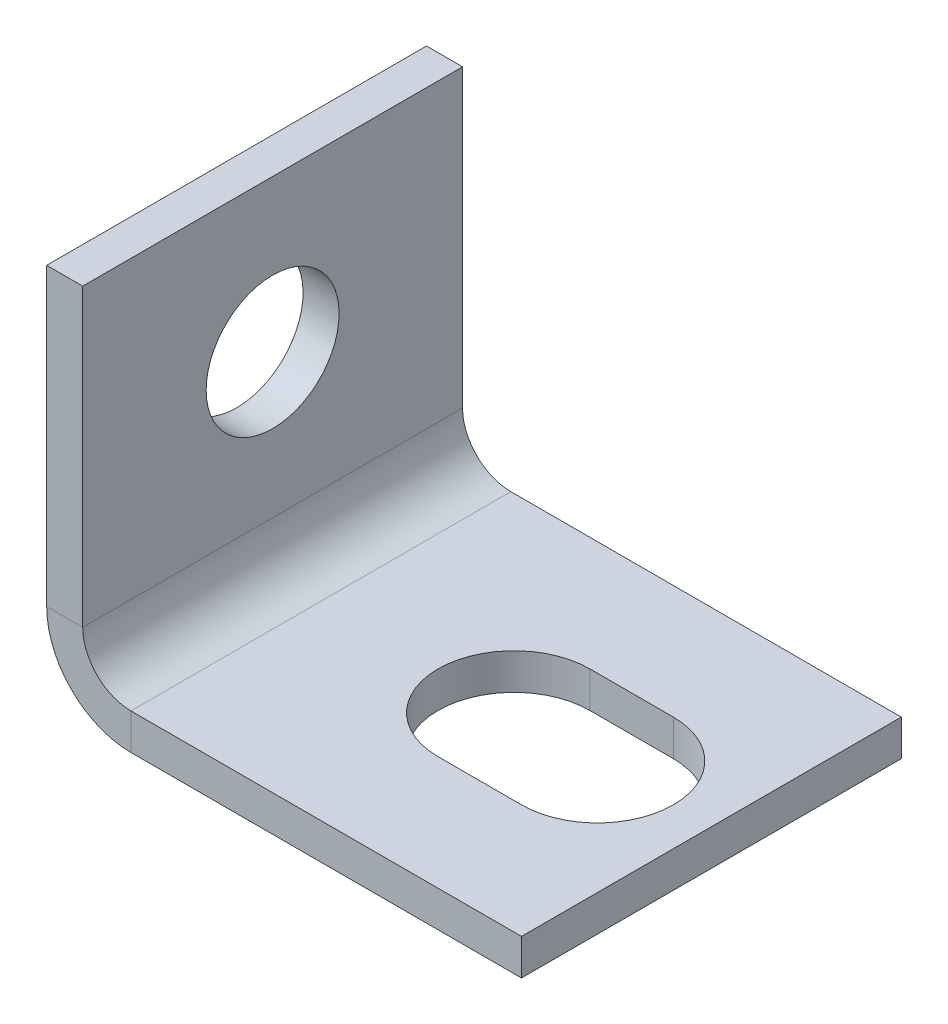
ISO-10303-21;
HEADER;
FILE_DESCRIPTION(('STEP AP214'),'2;1');
FILE_NAME('part.step','',(''),(''),'','','');
FILE_SCHEMA(('AUTOMOTIVE_DESIGN { 1 0 10303 214 1 1 1 1 }'));
ENDSEC;
DATA;
#1=APPLICATION_CONTEXT('core data for automotive mechanical design processes');
#2=APPLICATION_PROTOCOL_DEFINITION('international standard','automotive_design',2000,#1);
#3=PRODUCT_CONTEXT('',#1,'mechanical');
#4=PRODUCT('Part','Part','',(#3));
#5=PRODUCT_RELATED_PRODUCT_CATEGORY('part','',(#4));
#6=PRODUCT_DEFINITION_FORMATION('','',#4);
#7=PRODUCT_DEFINITION_CONTEXT('part definition',#1,'design');
#8=PRODUCT_DEFINITION('design','',#6,#7);
#9=PRODUCT_DEFINITION_SHAPE('','',#8);
#10=(LENGTH_UNIT() NAMED_UNIT(*) SI_UNIT(.MILLI.,.METRE.));
#11=(NAMED_UNIT(*) PLANE_ANGLE_UNIT() SI_UNIT($,.RADIAN.));
#12=(NAMED_UNIT(*) SI_UNIT($,.STERADIAN.) SOLID_ANGLE_UNIT());
#13=UNCERTAINTY_MEASURE_WITH_UNIT(LENGTH_MEASURE(1.E-05),#10,'distance_accuracy_value','');
#14=(GEOMETRIC_REPRESENTATION_CONTEXT(3) GLOBAL_UNCERTAINTY_ASSIGNED_CONTEXT((#13)) GLOBAL_UNIT_ASSIGNED_CONTEXT((#10,
#11,#12)) REPRESENTATION_CONTEXT('',''));
#15=CARTESIAN_POINT('',(0.,0.,0.));
#16=DIRECTION('',(0.,0.,1.));
#17=DIRECTION('',(1.,0.,0.));
#18=AXIS2_PLACEMENT_3D('',#15,#16,#17);
#19=CARTESIAN_POINT('',(-38.2833241606851,5.16675922041836,401.136685208081));
#20=DIRECTION('',(0.,0.,-1.));
#21=DIRECTION('',(0.,1.,0.));
#22=AXIS2_PLACEMENT_3D('',#19,#20,#21);
#23=PLANE('',#22);
#24=DIRECTION('',(0.,-1.,0.));
#25=VECTOR('',#24,1.);
#26=CARTESIAN_POINT('',(-33.8459441606851,5.16675922041836,401.136685208081));
#27=LINE('',#26,#25);
#28=CARTESIAN_POINT('',(-33.8459441606851,5.16675922041836,401.136685208081));
#29=VERTEX_POINT('',#28);
#30=CARTESIAN_POINT('',(-33.8459441606851,3.26937922041836,401.136685208081));
#31=VERTEX_POINT('',#30);
#32=EDGE_CURVE('E213',#29,#31,#27,.T.);
#33=ORIENTED_EDGE('',*,*,#32,.T.);
#34=DIRECTION('',(1.,0.,0.));
#35=VECTOR('',#34,1.);
#36=CARTESIAN_POINT('',(-38.2833241606851,3.26937922041836,401.136685208081));
#37=LINE('',#36,#35);
#38=CARTESIAN_POINT('',(-13.2833241606851,3.26937922041836,401.136685208081));
#39=VERTEX_POINT('',#38);
#40=EDGE_CURVE('E227',#31,#39,#37,.T.);
#41=ORIENTED_EDGE('',*,*,#40,.T.);
#42=DIRECTION('',(0.,-1.,0.));
#43=VECTOR('',#42,1.);
#44=CARTESIAN_POINT('',(-13.2833241606851,5.16675922041836,401.136685208081));
#45=LINE('',#44,#43);
#46=CARTESIAN_POINT('',(-13.2833241606851,5.16675922041836,401.136685208081));
#47=VERTEX_POINT('',#46);
#48=EDGE_CURVE('E245',#47,#39,#45,.T.);
#49=ORIENTED_EDGE('',*,*,#48,.F.);
#50=DIRECTION('',(1.,0.,0.));
#51=VECTOR('',#50,1.);
#52=CARTESIAN_POINT('',(-38.2833241606851,5.16675922041836,401.136685208081));
#53=LINE('',#52,#51);
#54=EDGE_CURVE('E229',#29,#47,#53,.T.);
#55=ORIENTED_EDGE('',*,*,#54,.F.);
#56=EDGE_LOOP('',(#33,#41,#49,#55));
#57=FACE_BOUND('',#56,.T.);
#58=ADVANCED_FACE('F56',(#57),#23,.F.);
#59=CARTESIAN_POINT('',(-38.2833241606851,5.16675922041843,381.136685208081));
#60=DIRECTION('',(0.,0.,1.));
#61=DIRECTION('',(0.,-1.,0.));
#62=AXIS2_PLACEMENT_3D('',#59,#60,#61);
#63=PLANE('',#62);
#64=DIRECTION('',(0.,-1.,0.));
#65=VECTOR('',#64,1.);
#66=CARTESIAN_POINT('',(-33.8459441606851,5.16675922041843,381.136685208081));
#67=LINE('',#66,#65);
#68=CARTESIAN_POINT('',(-33.8459441606851,5.16675922041843,381.136685208081));
#69=VERTEX_POINT('',#68);
#70=CARTESIAN_POINT('',(-33.8459441606851,3.26937922041843,381.136685208081));
#71=VERTEX_POINT('',#70);
#72=EDGE_CURVE('E224',#69,#71,#67,.T.);
#73=ORIENTED_EDGE('',*,*,#72,.F.);
#74=DIRECTION('',(-1.,0.,0.));
#75=VECTOR('',#74,1.);
#76=CARTESIAN_POINT('',(-38.2833241606851,5.16675922041843,381.136685208081));
#77=LINE('',#76,#75);
#78=CARTESIAN_POINT('',(-13.2833241606851,5.16675922041843,381.136685208081));
#79=VERTEX_POINT('',#78);
#80=EDGE_CURVE('E234',#79,#69,#77,.T.);
#81=ORIENTED_EDGE('',*,*,#80,.F.);
#82=DIRECTION('',(0.,-1.,0.));
#83=VECTOR('',#82,1.);
#84=CARTESIAN_POINT('',(-13.2833241606851,5.16675922041843,381.136685208081));
#85=LINE('',#84,#83);
#86=CARTESIAN_POINT('',(-13.2833241606851,3.26937922041843,381.136685208081));
#87=VERTEX_POINT('',#86);
#88=EDGE_CURVE('E237',#79,#87,#85,.T.);
#89=ORIENTED_EDGE('',*,*,#88,.T.);
#90=DIRECTION('',(-1.,0.,0.));
#91=VECTOR('',#90,1.);
#92=CARTESIAN_POINT('',(-38.2833241606851,3.26937922041843,381.136685208081));
#93=LINE('',#92,#91);
#94=EDGE_CURVE('E232',#87,#71,#93,.T.);
#95=ORIENTED_EDGE('',*,*,#94,.T.);
#96=EDGE_LOOP('',(#73,#81,#89,#95));
#97=FACE_BOUND('',#96,.T.);
#98=ADVANCED_FACE('F273',(#97),#63,.F.);
#99=CARTESIAN_POINT('',(0.,5.16675922041974,0.));
#100=DIRECTION('',(0.,1.,0.));
#101=DIRECTION('',(0.,0.,1.));
#102=AXIS2_PLACEMENT_3D('',#99,#100,#101);
#103=PLANE('',#102);
#104=CARTESIAN_POINT('',(-23.6788003948618,5.16675922041839,391.136685208081));
#105=DIRECTION('',(0.,1.,0.));
#106=DIRECTION('',(0.,0.,1.));
#107=AXIS2_PLACEMENT_3D('',#104,#105,#106);
#108=CIRCLE('',#107,4.);
#109=CARTESIAN_POINT('',(-23.6788003948618,5.16675922041841,387.136685208081));
#110=VERTEX_POINT('',#109);
#111=CARTESIAN_POINT('',(-23.6788003948618,5.16675922041838,395.136685208081));
#112=VERTEX_POINT('',#111);
#113=EDGE_CURVE('E70',#110,#112,#108,.T.);
#114=ORIENTED_EDGE('',*,*,#113,.F.);
#115=DIRECTION('',(-1.,0.,0.));
#116=VECTOR('',#115,1.);
#117=CARTESIAN_POINT('',(-23.6788003948618,5.16675922041841,387.136685208081));
#118=LINE('',#117,#116);
#119=CARTESIAN_POINT('',(-19.2833241606851,5.16675922041841,387.136685208081));
#120=VERTEX_POINT('',#119);
#121=EDGE_CURVE('E163',#120,#110,#118,.T.);
#122=ORIENTED_EDGE('',*,*,#121,.F.);
#123=CARTESIAN_POINT('',(-19.2833241606851,5.16675922041839,391.136685208081));
#124=DIRECTION('',(0.,1.,0.));
#125=DIRECTION('',(0.,0.,1.));
#126=AXIS2_PLACEMENT_3D('',#123,#124,#125);
#127=CIRCLE('',#126,4.);
#128=CARTESIAN_POINT('',(-19.2833241606851,5.16675922041838,395.136685208081));
#129=VERTEX_POINT('',#128);
#130=EDGE_CURVE('E147',#129,#120,#127,.T.);
#131=ORIENTED_EDGE('',*,*,#130,.F.);
#132=DIRECTION('',(1.,0.,0.));
#133=VECTOR('',#132,1.);
#134=CARTESIAN_POINT('',(-23.6788003948618,5.16675922041838,395.136685208081));
#135=LINE('',#134,#133);
#136=EDGE_CURVE('E156',#112,#129,#135,.T.);
#137=ORIENTED_EDGE('',*,*,#136,.F.);
#138=EDGE_LOOP('',(#114,#122,#131,#137));
#139=FACE_BOUND('',#138,.T.);
#140=ORIENTED_EDGE('',*,*,#80,.T.);
#141=DIRECTION('',(0.,0.,1.));
#142=VECTOR('',#141,1.);
#143=CARTESIAN_POINT('',(-33.8459441606851,5.16675922041836,401.136685208081));
#144=LINE('',#143,#142);
#145=EDGE_CURVE('E219',#29,#69,#144,.F.);
#146=ORIENTED_EDGE('',*,*,#145,.F.);
#147=ORIENTED_EDGE('',*,*,#54,.T.);
#148=DIRECTION('',(0.,0.,-1.));
#149=VECTOR('',#148,1.);
#150=CARTESIAN_POINT('',(-13.2833241606851,5.16675922041843,381.136685208081));
#151=LINE('',#150,#149);
#152=EDGE_CURVE('E231',#47,#79,#151,.T.);
#153=ORIENTED_EDGE('',*,*,#152,.T.);
#154=EDGE_LOOP('',(#140,#146,#147,#153));
#155=FACE_BOUND('',#154,.T.);
#156=ADVANCED_FACE('F160',(#139,#155),#103,.T.);
#157=CARTESIAN_POINT('',(0.,3.26937922041974,0.));
#158=DIRECTION('',(0.,1.,0.));
#159=DIRECTION('',(0.,0.,1.));
#160=AXIS2_PLACEMENT_3D('',#157,#158,#159);
#161=PLANE('',#160);
#162=DIRECTION('',(-1.,0.,0.));
#163=VECTOR('',#162,1.);
#164=CARTESIAN_POINT('',(0.,3.26937922041841,387.136685208081));
#165=LINE('',#164,#163);
#166=CARTESIAN_POINT('',(-19.2833241606851,3.26937922041838,387.136685208081));
#167=VERTEX_POINT('',#166);
#168=CARTESIAN_POINT('',(-23.6788003948618,3.26937922041841,387.136685208081));
#169=VERTEX_POINT('',#168);
#170=EDGE_CURVE('E63',#167,#169,#165,.T.);
#171=ORIENTED_EDGE('',*,*,#170,.T.);
#172=CARTESIAN_POINT('',(-23.6788003948618,3.2693792204184,391.136685208081));
#173=DIRECTION('',(0.,1.,0.));
#174=DIRECTION('',(0.,0.,1.));
#175=AXIS2_PLACEMENT_3D('',#172,#173,#174);
#176=CIRCLE('',#175,4.);
#177=CARTESIAN_POINT('',(-23.6788003948618,3.26937922041838,395.136685208081));
#178=VERTEX_POINT('',#177);
#179=EDGE_CURVE('E13',#169,#178,#176,.T.);
#180=ORIENTED_EDGE('',*,*,#179,.T.);
#181=DIRECTION('',(1.,0.,0.));
#182=VECTOR('',#181,1.);
#183=CARTESIAN_POINT('',(0.,3.26937922041838,395.136685208081));
#184=LINE('',#183,#182);
#185=CARTESIAN_POINT('',(-19.2833241606851,3.26937922041838,395.136685208081));
#186=VERTEX_POINT('',#185);
#187=EDGE_CURVE('E248',#178,#186,#184,.T.);
#188=ORIENTED_EDGE('',*,*,#187,.T.);
#189=CARTESIAN_POINT('',(-19.2833241606851,3.2693792204184,391.136685208081));
#190=DIRECTION('',(0.,1.,0.));
#191=DIRECTION('',(0.,0.,1.));
#192=AXIS2_PLACEMENT_3D('',#189,#190,#191);
#193=CIRCLE('',#192,4.);
#194=EDGE_CURVE('E150',#186,#167,#193,.T.);
#195=ORIENTED_EDGE('',*,*,#194,.T.);
#196=EDGE_LOOP('',(#171,#180,#188,#195));
#197=FACE_BOUND('',#196,.T.);
#198=DIRECTION('',(0.,0.,1.));
#199=VECTOR('',#198,1.);
#200=CARTESIAN_POINT('',(-33.8459441606851,3.26937922041836,401.136685208081));
#201=LINE('',#200,#199);
#202=EDGE_CURVE('E207',#31,#71,#201,.F.);
#203=ORIENTED_EDGE('',*,*,#202,.T.);
#204=ORIENTED_EDGE('',*,*,#94,.F.);
#205=DIRECTION('',(0.,0.,-1.));
#206=VECTOR('',#205,1.);
#207=CARTESIAN_POINT('',(-13.2833241606851,3.26937922041843,381.136685208081));
#208=LINE('',#207,#206);
#209=EDGE_CURVE('E239',#39,#87,#208,.T.);
#210=ORIENTED_EDGE('',*,*,#209,.F.);
#211=ORIENTED_EDGE('',*,*,#40,.F.);
#212=EDGE_LOOP('',(#203,#204,#210,#211));
#213=FACE_BOUND('',#212,.T.);
#214=ADVANCED_FACE('F254',(#197,#213),#161,.F.);
#215=CARTESIAN_POINT('',(-13.2833241606851,5.16675922041843,381.136685208081));
#216=DIRECTION('',(-1.,0.,0.));
#217=DIRECTION('',(0.,0.,1.));
#218=AXIS2_PLACEMENT_3D('',#215,#216,#217);
#219=PLANE('',#218);
#220=ORIENTED_EDGE('',*,*,#209,.T.);
#221=ORIENTED_EDGE('',*,*,#88,.F.);
#222=ORIENTED_EDGE('',*,*,#152,.F.);
#223=ORIENTED_EDGE('',*,*,#48,.T.);
#224=EDGE_LOOP('',(#220,#221,#222,#223));
#225=FACE_BOUND('',#224,.T.);
#226=ADVANCED_FACE('F340',(#225),#219,.F.);
#227=CARTESIAN_POINT('',(-33.8459441606851,7.70675922041843,381.136685208081));
#228=DIRECTION('',(0.,0.,-1.));
#229=DIRECTION('',(0.,1.,0.));
#230=AXIS2_PLACEMENT_3D('',#227,#228,#229);
#231=PLANE('',#230);
#232=DIRECTION('',(1.,0.,0.));
#233=VECTOR('',#232,1.);
#234=CARTESIAN_POINT('',(-38.2833241606851,7.70675922041841,381.136685208081));
#235=LINE('',#234,#233);
#236=CARTESIAN_POINT('',(-36.3859441606851,7.70675922041842,381.136685208081));
#237=VERTEX_POINT('',#236);
#238=CARTESIAN_POINT('',(-38.2833241606851,7.70675922041841,381.136685208081));
#239=VERTEX_POINT('',#238);
#240=EDGE_CURVE('E204',#237,#239,#235,.F.);
#241=ORIENTED_EDGE('',*,*,#240,.F.);
#242=CARTESIAN_POINT('',(-33.8459441606851,7.70675922041843,381.136685208081));
#243=DIRECTION('',(0.,0.,1.));
#244=DIRECTION('',(0.,-1.,0.));
#245=AXIS2_PLACEMENT_3D('',#242,#243,#244);
#246=CIRCLE('',#245,2.54);
#247=EDGE_CURVE('E216',#69,#237,#246,.F.);
#248=ORIENTED_EDGE('',*,*,#247,.F.);
#249=ORIENTED_EDGE('',*,*,#72,.T.);
#250=CARTESIAN_POINT('',(-33.8459441606851,7.70675922041843,381.136685208081));
#251=DIRECTION('',(0.,0.,1.));
#252=DIRECTION('',(0.,-1.,0.));
#253=AXIS2_PLACEMENT_3D('',#250,#251,#252);
#254=CIRCLE('',#253,4.43738);
#255=EDGE_CURVE('E209',#71,#239,#254,.F.);
#256=ORIENTED_EDGE('',*,*,#255,.T.);
#257=EDGE_LOOP('',(#241,#248,#249,#256));
#258=FACE_BOUND('',#257,.T.);
#259=ADVANCED_FACE('F312',(#258),#231,.T.);
#260=CARTESIAN_POINT('',(-33.8459441606851,7.70675922041836,401.136685208081));
#261=DIRECTION('',(0.,0.,-1.));
#262=DIRECTION('',(0.,1.,0.));
#263=AXIS2_PLACEMENT_3D('',#260,#261,#262);
#264=PLANE('',#263);
#265=CARTESIAN_POINT('',(-33.8459441606851,7.70675922041836,401.136685208081));
#266=DIRECTION('',(0.,0.,1.));
#267=DIRECTION('',(0.,-1.,0.));
#268=AXIS2_PLACEMENT_3D('',#265,#266,#267);
#269=CIRCLE('',#268,2.54);
#270=CARTESIAN_POINT('',(-36.3859441606851,7.70675922041835,401.136685208081));
#271=VERTEX_POINT('',#270);
#272=EDGE_CURVE('E179',#271,#29,#269,.T.);
#273=ORIENTED_EDGE('',*,*,#272,.F.);
#274=DIRECTION('',(1.,0.,0.));
#275=VECTOR('',#274,1.);
#276=CARTESIAN_POINT('',(-36.3859441606851,7.70675922041835,401.136685208081));
#277=LINE('',#276,#275);
#278=CARTESIAN_POINT('',(-38.2833241606851,7.70675922041834,401.136685208081));
#279=VERTEX_POINT('',#278);
#280=EDGE_CURVE('E199',#271,#279,#277,.F.);
#281=ORIENTED_EDGE('',*,*,#280,.T.);
#282=CARTESIAN_POINT('',(-33.8459441606851,7.70675922041836,401.136685208081));
#283=DIRECTION('',(0.,0.,1.));
#284=DIRECTION('',(0.,-1.,0.));
#285=AXIS2_PLACEMENT_3D('',#282,#283,#284);
#286=CIRCLE('',#285,4.43738);
#287=EDGE_CURVE('E210',#279,#31,#286,.T.);
#288=ORIENTED_EDGE('',*,*,#287,.T.);
#289=ORIENTED_EDGE('',*,*,#32,.F.);
#290=EDGE_LOOP('',(#273,#281,#288,#289));
#291=FACE_BOUND('',#290,.T.);
#292=ADVANCED_FACE('F292',(#291),#264,.F.);
#293=CARTESIAN_POINT('',(-33.8459441606851,7.70675922041836,401.136685208081));
#294=DIRECTION('',(0.,0.,1.));
#295=DIRECTION('',(-1.,0.,0.));
#296=AXIS2_PLACEMENT_3D('',#293,#294,#295);
#297=CYLINDRICAL_SURFACE('',#296,4.43738);
#298=ORIENTED_EDGE('',*,*,#202,.F.);
#299=ORIENTED_EDGE('',*,*,#287,.F.);
#300=DIRECTION('',(0.,0.,1.));
#301=VECTOR('',#300,1.);
#302=CARTESIAN_POINT('',(-38.2833241606851,7.70675922041841,381.136685208081));
#303=LINE('',#302,#301);
#304=EDGE_CURVE('E197',#279,#239,#303,.F.);
#305=ORIENTED_EDGE('',*,*,#304,.T.);
#306=ORIENTED_EDGE('',*,*,#255,.F.);
#307=EDGE_LOOP('',(#298,#299,#305,#306));
#308=FACE_BOUND('',#307,.T.);
#309=ADVANCED_FACE('F291',(#308),#297,.T.);
#310=CARTESIAN_POINT('',(-33.8459441606851,7.70675922041836,401.136685208081));
#311=DIRECTION('',(0.,0.,1.));
#312=DIRECTION('',(-1.,0.,0.));
#313=AXIS2_PLACEMENT_3D('',#310,#311,#312);
#314=CYLINDRICAL_SURFACE('',#313,2.54);
#315=ORIENTED_EDGE('',*,*,#145,.T.);
#316=ORIENTED_EDGE('',*,*,#247,.T.);
#317=DIRECTION('',(0.,0.,1.));
#318=VECTOR('',#317,1.);
#319=CARTESIAN_POINT('',(-36.3859441606851,7.70675922041842,381.136685208081));
#320=LINE('',#319,#318);
#321=EDGE_CURVE('E202',#237,#271,#320,.T.);
#322=ORIENTED_EDGE('',*,*,#321,.T.);
#323=ORIENTED_EDGE('',*,*,#272,.T.);
#324=EDGE_LOOP('',(#315,#316,#322,#323));
#325=FACE_BOUND('',#324,.T.);
#326=ADVANCED_FACE('F315',(#325),#314,.F.);
#327=CARTESIAN_POINT('',(-38.2833241606852,23.2693792204183,401.136685208081));
#328=DIRECTION('',(0.,0.,-1.));
#329=DIRECTION('',(-1.,0.,0.));
#330=AXIS2_PLACEMENT_3D('',#327,#328,#329);
#331=PLANE('',#330);
#332=ORIENTED_EDGE('',*,*,#280,.F.);
#333=DIRECTION('',(0.,-1.,0.));
#334=VECTOR('',#333,1.);
#335=CARTESIAN_POINT('',(-36.3859441606852,23.2693792204184,401.136685208081));
#336=LINE('',#335,#334);
#337=CARTESIAN_POINT('',(-36.3859441606852,23.2693792204184,401.136685208081));
#338=VERTEX_POINT('',#337);
#339=EDGE_CURVE('E195',#271,#338,#336,.F.);
#340=ORIENTED_EDGE('',*,*,#339,.T.);
#341=DIRECTION('',(1.,0.,0.));
#342=VECTOR('',#341,1.);
#343=CARTESIAN_POINT('',(-38.2833241606852,23.2693792204183,401.136685208081));
#344=LINE('',#343,#342);
#345=CARTESIAN_POINT('',(-38.2833241606852,23.2693792204183,401.136685208081));
#346=VERTEX_POINT('',#345);
#347=EDGE_CURVE('E176',#346,#338,#344,.T.);
#348=ORIENTED_EDGE('',*,*,#347,.F.);
#349=DIRECTION('',(0.,1.,0.));
#350=VECTOR('',#349,1.);
#351=CARTESIAN_POINT('',(-38.2833241606851,-1.38693689013021E-13,401.136685208081));
#352=LINE('',#351,#350);
#353=EDGE_CURVE('E188',#279,#346,#352,.T.);
#354=ORIENTED_EDGE('',*,*,#353,.F.);
#355=EDGE_LOOP('',(#332,#340,#348,#354));
#356=FACE_BOUND('',#355,.T.);
#357=ADVANCED_FACE('F302',(#356),#331,.F.);
#358=CARTESIAN_POINT('',(-38.2833241606851,5.16675922041842,381.136685208081));
#359=DIRECTION('',(0.,0.,1.));
#360=DIRECTION('',(0.,-1.,0.));
#361=AXIS2_PLACEMENT_3D('',#358,#359,#360);
#362=PLANE('',#361);
#363=ORIENTED_EDGE('',*,*,#240,.T.);
#364=DIRECTION('',(0.,-1.,0.));
#365=VECTOR('',#364,1.);
#366=CARTESIAN_POINT('',(-38.2833241606851,-1.30743811232667E-12,381.136685208081));
#367=LINE('',#366,#365);
#368=CARTESIAN_POINT('',(-38.2833241606852,23.2693792204184,381.136685208081));
#369=VERTEX_POINT('',#368);
#370=EDGE_CURVE('E183',#369,#239,#367,.T.);
#371=ORIENTED_EDGE('',*,*,#370,.F.);
#372=DIRECTION('',(1.,0.,0.));
#373=VECTOR('',#372,1.);
#374=CARTESIAN_POINT('',(-38.2833241606852,23.2693792204184,381.136685208081));
#375=LINE('',#374,#373);
#376=CARTESIAN_POINT('',(-36.3859441606852,23.2693792204184,381.136685208081));
#377=VERTEX_POINT('',#376);
#378=EDGE_CURVE('E180',#369,#377,#375,.T.);
#379=ORIENTED_EDGE('',*,*,#378,.T.);
#380=DIRECTION('',(0.,1.,0.));
#381=VECTOR('',#380,1.);
#382=CARTESIAN_POINT('',(-36.3859441606851,5.16675922041843,381.136685208081));
#383=LINE('',#382,#381);
#384=EDGE_CURVE('E190',#377,#237,#383,.F.);
#385=ORIENTED_EDGE('',*,*,#384,.T.);
#386=EDGE_LOOP('',(#363,#371,#379,#385));
#387=FACE_BOUND('',#386,.T.);
#388=ADVANCED_FACE('F309',(#387),#362,.F.);
#389=CARTESIAN_POINT('',(-38.2833241606851,-1.38693689013021E-13,0.));
#390=DIRECTION('',(1.,0.,0.));
#391=DIRECTION('',(0.,1.,0.));
#392=AXIS2_PLACEMENT_3D('',#389,#390,#391);
#393=PLANE('',#392);
#394=CARTESIAN_POINT('',(-38.2833241606852,15.2693792204184,391.136685208081));
#395=DIRECTION('',(-1.,0.,0.));
#396=DIRECTION('',(0.,-1.,0.));
#397=AXIS2_PLACEMENT_3D('',#394,#395,#396);
#398=CIRCLE('',#397,3.50000000000002);
#399=CARTESIAN_POINT('',(-38.2833241606851,11.7693792204184,391.136685208081));
#400=VERTEX_POINT('',#399);
#401=EDGE_CURVE('E170',#400,#400,#398,.T.);
#402=ORIENTED_EDGE('',*,*,#401,.F.);
#403=EDGE_LOOP('',(#402));
#404=FACE_BOUND('',#403,.T.);
#405=ORIENTED_EDGE('',*,*,#304,.F.);
#406=ORIENTED_EDGE('',*,*,#353,.T.);
#407=DIRECTION('',(0.,0.,-1.));
#408=VECTOR('',#407,1.);
#409=CARTESIAN_POINT('',(-38.2833241606852,23.2693792204197,0.));
#410=LINE('',#409,#408);
#411=EDGE_CURVE('E186',#346,#369,#410,.T.);
#412=ORIENTED_EDGE('',*,*,#411,.T.);
#413=ORIENTED_EDGE('',*,*,#370,.T.);
#414=EDGE_LOOP('',(#405,#406,#412,#413));
#415=FACE_BOUND('',#414,.T.);
#416=ADVANCED_FACE('F299',(#404,#415),#393,.F.);
#417=CARTESIAN_POINT('',(-36.3859441606851,-1.32069022150326E-13,0.));
#418=DIRECTION('',(1.,0.,0.));
#419=DIRECTION('',(0.,1.,0.));
#420=AXIS2_PLACEMENT_3D('',#417,#418,#419);
#421=PLANE('',#420);
#422=CARTESIAN_POINT('',(-36.3859441606852,15.2693792204184,391.136685208081));
#423=DIRECTION('',(1.,0.,0.));
#424=DIRECTION('',(0.,1.,0.));
#425=AXIS2_PLACEMENT_3D('',#422,#423,#424);
#426=CIRCLE('',#425,3.50000000000002);
#427=CARTESIAN_POINT('',(-36.3859441606852,18.7693792204184,391.136685208081));
#428=VERTEX_POINT('',#427);
#429=EDGE_CURVE('E175',#428,#428,#426,.T.);
#430=ORIENTED_EDGE('',*,*,#429,.F.);
#431=EDGE_LOOP('',(#430));
#432=FACE_BOUND('',#431,.T.);
#433=ORIENTED_EDGE('',*,*,#339,.F.);
#434=ORIENTED_EDGE('',*,*,#321,.F.);
#435=ORIENTED_EDGE('',*,*,#384,.F.);
#436=DIRECTION('',(0.,0.,1.));
#437=VECTOR('',#436,1.);
#438=CARTESIAN_POINT('',(-36.3859441606852,23.2693792204184,381.136685208081));
#439=LINE('',#438,#437);
#440=EDGE_CURVE('E193',#338,#377,#439,.F.);
#441=ORIENTED_EDGE('',*,*,#440,.F.);
#442=EDGE_LOOP('',(#433,#434,#435,#441));
#443=FACE_BOUND('',#442,.T.);
#444=ADVANCED_FACE('F317',(#432,#443),#421,.T.);
#445=CARTESIAN_POINT('',(-38.2833241606852,23.2693792204184,381.136685208081));
#446=DIRECTION('',(0.,-1.,0.));
#447=DIRECTION('',(1.,0.,0.));
#448=AXIS2_PLACEMENT_3D('',#445,#446,#447);
#449=PLANE('',#448);
#450=ORIENTED_EDGE('',*,*,#440,.T.);
#451=ORIENTED_EDGE('',*,*,#378,.F.);
#452=ORIENTED_EDGE('',*,*,#411,.F.);
#453=ORIENTED_EDGE('',*,*,#347,.T.);
#454=EDGE_LOOP('',(#450,#451,#452,#453));
#455=FACE_BOUND('',#454,.T.);
#456=ADVANCED_FACE('F268',(#455),#449,.F.);
#457=CARTESIAN_POINT('',(-28.2833241606852,15.2693792204184,391.136685208081));
#458=DIRECTION('',(-1.,0.,0.));
#459=DIRECTION('',(0.,-1.,0.));
#460=AXIS2_PLACEMENT_3D('',#457,#458,#459);
#461=CYLINDRICAL_SURFACE('',#460,3.50000000000002);
#462=ORIENTED_EDGE('',*,*,#429,.T.);
#463=EDGE_LOOP('',(#462));
#464=FACE_BOUND('',#463,.T.);
#465=ORIENTED_EDGE('',*,*,#401,.T.);
#466=EDGE_LOOP('',(#465));
#467=FACE_BOUND('',#466,.T.);
#468=ADVANCED_FACE('F261',(#464,#467),#461,.F.);
#469=CARTESIAN_POINT('',(-23.6788003948618,-4.83324077958161,391.136685208081));
#470=DIRECTION('',(0.,1.,0.));
#471=DIRECTION('',(0.,0.,1.));
#472=AXIS2_PLACEMENT_3D('',#469,#470,#471);
#473=CYLINDRICAL_SURFACE('',#472,4.);
#474=DIRECTION('',(0.,1.,0.));
#475=VECTOR('',#474,1.);
#476=CARTESIAN_POINT('',(-23.6788003948618,-4.83324077958159,387.136685208081));
#477=LINE('',#476,#475);
#478=EDGE_CURVE('E168',#169,#110,#477,.T.);
#479=ORIENTED_EDGE('',*,*,#478,.T.);
#480=ORIENTED_EDGE('',*,*,#113,.T.);
#481=DIRECTION('',(0.,1.,0.));
#482=VECTOR('',#481,1.);
#483=CARTESIAN_POINT('',(-23.6788003948618,-4.83324077958162,395.136685208081));
#484=LINE('',#483,#482);
#485=EDGE_CURVE('E153',#178,#112,#484,.T.);
#486=ORIENTED_EDGE('',*,*,#485,.F.);
#487=ORIENTED_EDGE('',*,*,#179,.F.);
#488=EDGE_LOOP('',(#479,#480,#486,#487));
#489=FACE_BOUND('',#488,.T.);
#490=ADVANCED_FACE('F259',(#489),#473,.F.);
#491=CARTESIAN_POINT('',(-23.6788003948618,-4.83324077958159,387.136685208081));
#492=DIRECTION('',(0.,0.,-1.));
#493=DIRECTION('',(0.,1.,0.));
#494=AXIS2_PLACEMENT_3D('',#491,#492,#493);
#495=PLANE('',#494);
#496=DIRECTION('',(0.,1.,0.));
#497=VECTOR('',#496,1.);
#498=CARTESIAN_POINT('',(-19.2833241606851,-4.83324077958159,387.136685208081));
#499=LINE('',#498,#497);
#500=EDGE_CURVE('E152',#167,#120,#499,.T.);
#501=ORIENTED_EDGE('',*,*,#500,.T.);
#502=ORIENTED_EDGE('',*,*,#121,.T.);
#503=ORIENTED_EDGE('',*,*,#478,.F.);
#504=ORIENTED_EDGE('',*,*,#170,.F.);
#505=EDGE_LOOP('',(#501,#502,#503,#504));
#506=FACE_BOUND('',#505,.T.);
#507=ADVANCED_FACE('F258',(#506),#495,.F.);
#508=CARTESIAN_POINT('',(-19.2833241606851,-4.83324077958161,391.136685208081));
#509=DIRECTION('',(0.,1.,0.));
#510=DIRECTION('',(0.,0.,1.));
#511=AXIS2_PLACEMENT_3D('',#508,#509,#510);
#512=CYLINDRICAL_SURFACE('',#511,4.);
#513=DIRECTION('',(0.,1.,0.));
#514=VECTOR('',#513,1.);
#515=CARTESIAN_POINT('',(-19.2833241606851,-4.83324077958162,395.136685208081));
#516=LINE('',#515,#514);
#517=EDGE_CURVE('E78',#186,#129,#516,.T.);
#518=ORIENTED_EDGE('',*,*,#517,.T.);
#519=ORIENTED_EDGE('',*,*,#130,.T.);
#520=ORIENTED_EDGE('',*,*,#500,.F.);
#521=ORIENTED_EDGE('',*,*,#194,.F.);
#522=EDGE_LOOP('',(#518,#519,#520,#521));
#523=FACE_BOUND('',#522,.T.);
#524=ADVANCED_FACE('F144',(#523),#512,.F.);
#525=CARTESIAN_POINT('',(-23.6788003948618,-4.83324077958162,395.136685208081));
#526=DIRECTION('',(0.,0.,1.));
#527=DIRECTION('',(0.,-1.,0.));
#528=AXIS2_PLACEMENT_3D('',#525,#526,#527);
#529=PLANE('',#528);
#530=ORIENTED_EDGE('',*,*,#485,.T.);
#531=ORIENTED_EDGE('',*,*,#136,.T.);
#532=ORIENTED_EDGE('',*,*,#517,.F.);
#533=ORIENTED_EDGE('',*,*,#187,.F.);
#534=EDGE_LOOP('',(#530,#531,#532,#533));
#535=FACE_BOUND('',#534,.T.);
#536=ADVANCED_FACE('F157',(#535),#529,.F.);
#537=CLOSED_SHELL('',(#58,#98,#156,#214,#226,#259,#292,#309,#326,#357,#388,#416,#444,#456,#468,
#490,#507,#524,#536));
#538=MANIFOLD_SOLID_BREP('B2',#537);
#539=ADVANCED_BREP_SHAPE_REPRESENTATION('',(#18,#538),#14);
#540=SHAPE_DEFINITION_REPRESENTATION(#9,#539);
ENDSEC;
END-ISO-10303-21;
